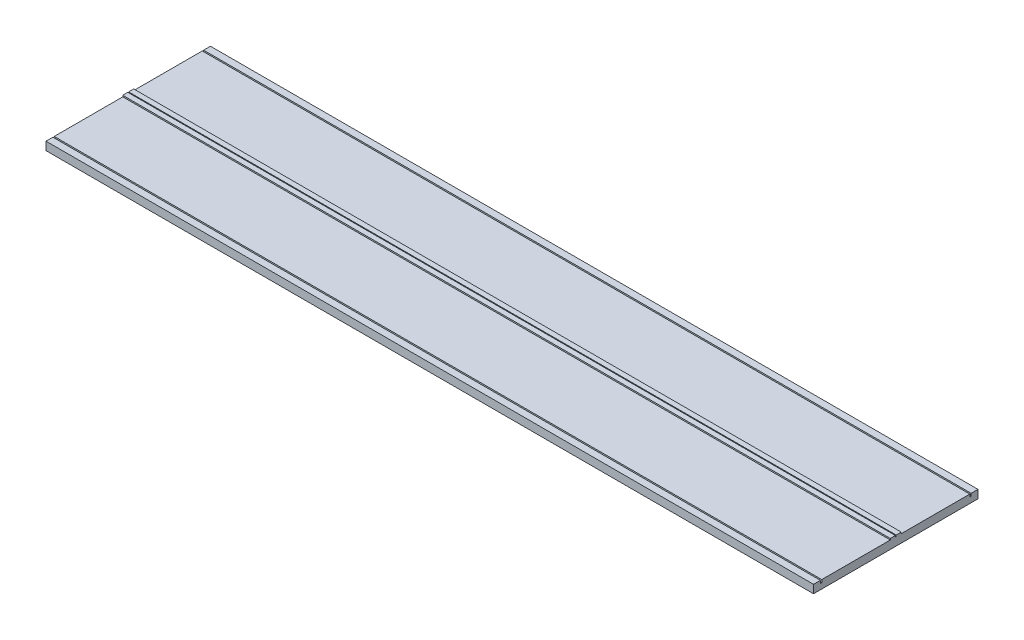
ISO-10303-21;
HEADER;
FILE_DESCRIPTION(('STEP AP214'),'2;1');
FILE_NAME('part.step','',(''),(''),'','','');
FILE_SCHEMA(('AUTOMOTIVE_DESIGN { 1 0 10303 214 1 1 1 1 }'));
ENDSEC;
DATA;
#1=APPLICATION_CONTEXT('core data for automotive mechanical design processes');
#2=APPLICATION_PROTOCOL_DEFINITION('international standard','automotive_design',2000,#1);
#3=PRODUCT_CONTEXT('',#1,'mechanical');
#4=PRODUCT('Part','Part','',(#3));
#5=PRODUCT_RELATED_PRODUCT_CATEGORY('part','',(#4));
#6=PRODUCT_DEFINITION_FORMATION('','',#4);
#7=PRODUCT_DEFINITION_CONTEXT('part definition',#1,'design');
#8=PRODUCT_DEFINITION('design','',#6,#7);
#9=PRODUCT_DEFINITION_SHAPE('','',#8);
#10=(LENGTH_UNIT() NAMED_UNIT(*) SI_UNIT(.MILLI.,.METRE.));
#11=(NAMED_UNIT(*) PLANE_ANGLE_UNIT() SI_UNIT($,.RADIAN.));
#12=(NAMED_UNIT(*) SI_UNIT($,.STERADIAN.) SOLID_ANGLE_UNIT());
#13=UNCERTAINTY_MEASURE_WITH_UNIT(LENGTH_MEASURE(1.E-05),#10,'distance_accuracy_value','');
#14=(GEOMETRIC_REPRESENTATION_CONTEXT(3) GLOBAL_UNCERTAINTY_ASSIGNED_CONTEXT((#13)) GLOBAL_UNIT_ASSIGNED_CONTEXT((#10,
#11,#12)) REPRESENTATION_CONTEXT('',''));
#15=CARTESIAN_POINT('',(0.,0.,0.));
#16=DIRECTION('',(0.,0.,1.));
#17=DIRECTION('',(1.,0.,0.));
#18=AXIS2_PLACEMENT_3D('',#15,#16,#17);
#19=CARTESIAN_POINT('',(-140.,-3.,30.));
#20=DIRECTION('',(1.,0.,0.));
#21=DIRECTION('',(0.,0.,-1.));
#22=AXIS2_PLACEMENT_3D('',#19,#20,#21);
#23=PLANE('',#22);
#24=DIRECTION('',(0.,-1.,0.));
#25=VECTOR('',#24,1.);
#26=CARTESIAN_POINT('',(-140.,0.,-0.15));
#27=LINE('',#26,#25);
#28=CARTESIAN_POINT('',(-140.,0.5,-0.15));
#29=VERTEX_POINT('',#28);
#30=CARTESIAN_POINT('',(-140.,0.,-0.15));
#31=VERTEX_POINT('',#30);
#32=EDGE_CURVE('E183',#29,#31,#27,.T.);
#33=ORIENTED_EDGE('',*,*,#32,.F.);
#34=DIRECTION('',(0.,0.,-1.));
#35=VECTOR('',#34,1.);
#36=CARTESIAN_POINT('',(-140.,0.5,0.));
#37=LINE('',#36,#35);
#38=CARTESIAN_POINT('',(-140.,0.5,-1.99999999999999));
#39=VERTEX_POINT('',#38);
#40=EDGE_CURVE('E211',#29,#39,#37,.T.);
#41=ORIENTED_EDGE('',*,*,#40,.T.);
#42=DIRECTION('',(0.,-1.,0.));
#43=VECTOR('',#42,1.);
#44=CARTESIAN_POINT('',(-140.,0.5,-1.99999999999999));
#45=LINE('',#44,#43);
#46=CARTESIAN_POINT('',(-140.,0.,-2.));
#47=VERTEX_POINT('',#46);
#48=EDGE_CURVE('E210',#39,#47,#45,.T.);
#49=ORIENTED_EDGE('',*,*,#48,.T.);
#50=DIRECTION('',(0.,0.,-1.));
#51=VECTOR('',#50,1.);
#52=CARTESIAN_POINT('',(-140.,0.,30.));
#53=LINE('',#52,#51);
#54=CARTESIAN_POINT('',(-140.,0.,-27.));
#55=VERTEX_POINT('',#54);
#56=EDGE_CURVE('E315',#47,#55,#53,.T.);
#57=ORIENTED_EDGE('',*,*,#56,.T.);
#58=DIRECTION('',(0.,1.,0.));
#59=VECTOR('',#58,1.);
#60=CARTESIAN_POINT('',(-140.,-1.,-27.));
#61=LINE('',#60,#59);
#62=CARTESIAN_POINT('',(-140.,-1.,-27.));
#63=VERTEX_POINT('',#62);
#64=EDGE_CURVE('E275',#63,#55,#61,.T.);
#65=ORIENTED_EDGE('',*,*,#64,.F.);
#66=DIRECTION('',(0.,0.,1.));
#67=VECTOR('',#66,1.);
#68=CARTESIAN_POINT('',(-140.,-1.,-27.5));
#69=LINE('',#68,#67);
#70=CARTESIAN_POINT('',(-140.,-1.,-27.5));
#71=VERTEX_POINT('',#70);
#72=EDGE_CURVE('E263',#71,#63,#69,.T.);
#73=ORIENTED_EDGE('',*,*,#72,.F.);
#74=DIRECTION('',(0.,1.,0.));
#75=VECTOR('',#74,1.);
#76=CARTESIAN_POINT('',(-140.,-1.,-27.5));
#77=LINE('',#76,#75);
#78=CARTESIAN_POINT('',(-140.,0.,-27.5));
#79=VERTEX_POINT('',#78);
#80=EDGE_CURVE('E280',#71,#79,#77,.T.);
#81=ORIENTED_EDGE('',*,*,#80,.T.);
#82=CARTESIAN_POINT('',(-140.,0.,-30.));
#83=VERTEX_POINT('',#82);
#84=EDGE_CURVE('E312',#79,#83,#53,.T.);
#85=ORIENTED_EDGE('',*,*,#84,.T.);
#86=DIRECTION('',(0.,1.,0.));
#87=VECTOR('',#86,1.);
#88=CARTESIAN_POINT('',(-140.,-3.,-30.));
#89=LINE('',#88,#87);
#90=CARTESIAN_POINT('',(-140.,-3.,-30.));
#91=VERTEX_POINT('',#90);
#92=EDGE_CURVE('E44',#91,#83,#89,.T.);
#93=ORIENTED_EDGE('',*,*,#92,.F.);
#94=DIRECTION('',(0.,0.,-1.));
#95=VECTOR('',#94,1.);
#96=CARTESIAN_POINT('',(-140.,-3.,30.));
#97=LINE('',#96,#95);
#98=CARTESIAN_POINT('',(-140.,-3.,30.));
#99=VERTEX_POINT('',#98);
#100=EDGE_CURVE('E300',#99,#91,#97,.T.);
#101=ORIENTED_EDGE('',*,*,#100,.F.);
#102=DIRECTION('',(0.,1.,0.));
#103=VECTOR('',#102,1.);
#104=CARTESIAN_POINT('',(-140.,-3.,30.));
#105=LINE('',#104,#103);
#106=CARTESIAN_POINT('',(-140.,0.,30.));
#107=VERTEX_POINT('',#106);
#108=EDGE_CURVE('E11',#99,#107,#105,.T.);
#109=ORIENTED_EDGE('',*,*,#108,.T.);
#110=CARTESIAN_POINT('',(-140.,0.,27.5));
#111=VERTEX_POINT('',#110);
#112=EDGE_CURVE('E295',#107,#111,#53,.T.);
#113=ORIENTED_EDGE('',*,*,#112,.T.);
#114=DIRECTION('',(0.,1.,0.));
#115=VECTOR('',#114,1.);
#116=CARTESIAN_POINT('',(-140.,-1.,27.5));
#117=LINE('',#116,#115);
#118=CARTESIAN_POINT('',(-140.,-1.,27.5));
#119=VERTEX_POINT('',#118);
#120=EDGE_CURVE('E250',#119,#111,#117,.T.);
#121=ORIENTED_EDGE('',*,*,#120,.F.);
#122=DIRECTION('',(0.,0.,-1.));
#123=VECTOR('',#122,1.);
#124=CARTESIAN_POINT('',(-140.,-1.,27.5));
#125=LINE('',#124,#123);
#126=CARTESIAN_POINT('',(-140.,-1.,27.));
#127=VERTEX_POINT('',#126);
#128=EDGE_CURVE('E238',#119,#127,#125,.T.);
#129=ORIENTED_EDGE('',*,*,#128,.T.);
#130=DIRECTION('',(0.,1.,0.));
#131=VECTOR('',#130,1.);
#132=CARTESIAN_POINT('',(-140.,-1.,27.));
#133=LINE('',#132,#131);
#134=CARTESIAN_POINT('',(-140.,0.,27.));
#135=VERTEX_POINT('',#134);
#136=EDGE_CURVE('E253',#127,#135,#133,.T.);
#137=ORIENTED_EDGE('',*,*,#136,.T.);
#138=CARTESIAN_POINT('',(-140.,0.,2.00000000000003));
#139=VERTEX_POINT('',#138);
#140=EDGE_CURVE('E314',#135,#139,#53,.T.);
#141=ORIENTED_EDGE('',*,*,#140,.T.);
#142=DIRECTION('',(0.,-1.,0.));
#143=VECTOR('',#142,1.);
#144=CARTESIAN_POINT('',(-140.,0.5,2.00000000000003));
#145=LINE('',#144,#143);
#146=CARTESIAN_POINT('',(-140.,0.5,2.00000000000003));
#147=VERTEX_POINT('',#146);
#148=EDGE_CURVE('E214',#147,#139,#145,.T.);
#149=ORIENTED_EDGE('',*,*,#148,.F.);
#150=CARTESIAN_POINT('',(-140.,0.5,0.150000000000042));
#151=VERTEX_POINT('',#150);
#152=EDGE_CURVE('E193',#147,#151,#37,.T.);
#153=ORIENTED_EDGE('',*,*,#152,.T.);
#154=DIRECTION('',(0.,-1.,0.));
#155=VECTOR('',#154,1.);
#156=CARTESIAN_POINT('',(-140.,0.,0.15));
#157=LINE('',#156,#155);
#158=CARTESIAN_POINT('',(-140.,0.,0.15));
#159=VERTEX_POINT('',#158);
#160=EDGE_CURVE('E52',#151,#159,#157,.T.);
#161=ORIENTED_EDGE('',*,*,#160,.T.);
#162=DIRECTION('',(0.,0.,1.));
#163=VECTOR('',#162,1.);
#164=CARTESIAN_POINT('',(-140.,0.,0.));
#165=LINE('',#164,#163);
#166=EDGE_CURVE('E175',#31,#159,#165,.T.);
#167=ORIENTED_EDGE('',*,*,#166,.F.);
#168=EDGE_LOOP('',(#33,#41,#49,#57,#65,#73,#81,#85,#93,#101,#109,#113,#121,#129,#137,#141,#149,
#153,#161,#167));
#169=FACE_BOUND('',#168,.T.);
#170=ADVANCED_FACE('F35',(#169),#23,.F.);
#171=CARTESIAN_POINT('',(140.,-3.,30.));
#172=DIRECTION('',(1.,0.,0.));
#173=DIRECTION('',(0.,0.,-1.));
#174=AXIS2_PLACEMENT_3D('',#171,#172,#173);
#175=PLANE('',#174);
#176=DIRECTION('',(0.,0.,1.));
#177=VECTOR('',#176,1.);
#178=CARTESIAN_POINT('',(140.,0.5,0.));
#179=LINE('',#178,#177);
#180=CARTESIAN_POINT('',(140.,0.5,-1.99999999999999));
#181=VERTEX_POINT('',#180);
#182=CARTESIAN_POINT('',(140.,0.5,-0.15));
#183=VERTEX_POINT('',#182);
#184=EDGE_CURVE('E224',#181,#183,#179,.T.);
#185=ORIENTED_EDGE('',*,*,#184,.T.);
#186=DIRECTION('',(0.,-1.,0.));
#187=VECTOR('',#186,1.);
#188=CARTESIAN_POINT('',(140.,0.,-0.15));
#189=LINE('',#188,#187);
#190=CARTESIAN_POINT('',(140.,0.,-0.15));
#191=VERTEX_POINT('',#190);
#192=EDGE_CURVE('E194',#183,#191,#189,.T.);
#193=ORIENTED_EDGE('',*,*,#192,.T.);
#194=DIRECTION('',(0.,0.,1.));
#195=VECTOR('',#194,1.);
#196=CARTESIAN_POINT('',(140.,0.,0.));
#197=LINE('',#196,#195);
#198=CARTESIAN_POINT('',(140.,0.,0.15));
#199=VERTEX_POINT('',#198);
#200=EDGE_CURVE('E197',#191,#199,#197,.T.);
#201=ORIENTED_EDGE('',*,*,#200,.T.);
#202=DIRECTION('',(0.,-1.,0.));
#203=VECTOR('',#202,1.);
#204=CARTESIAN_POINT('',(140.,0.,0.15));
#205=LINE('',#204,#203);
#206=CARTESIAN_POINT('',(140.,0.499999999999988,0.150000000000042));
#207=VERTEX_POINT('',#206);
#208=EDGE_CURVE('E187',#207,#199,#205,.T.);
#209=ORIENTED_EDGE('',*,*,#208,.F.);
#210=CARTESIAN_POINT('',(140.,0.5,2.00000000000003));
#211=VERTEX_POINT('',#210);
#212=EDGE_CURVE('E223',#207,#211,#179,.T.);
#213=ORIENTED_EDGE('',*,*,#212,.T.);
#214=DIRECTION('',(0.,-1.,0.));
#215=VECTOR('',#214,1.);
#216=CARTESIAN_POINT('',(140.,0.5,2.00000000000003));
#217=LINE('',#216,#215);
#218=CARTESIAN_POINT('',(140.,0.,2.00000000000003));
#219=VERTEX_POINT('',#218);
#220=EDGE_CURVE('E220',#211,#219,#217,.T.);
#221=ORIENTED_EDGE('',*,*,#220,.T.);
#222=DIRECTION('',(0.,0.,-1.));
#223=VECTOR('',#222,1.);
#224=CARTESIAN_POINT('',(140.,0.,30.));
#225=LINE('',#224,#223);
#226=CARTESIAN_POINT('',(140.,0.,27.));
#227=VERTEX_POINT('',#226);
#228=EDGE_CURVE('E60',#227,#219,#225,.T.);
#229=ORIENTED_EDGE('',*,*,#228,.F.);
#230=DIRECTION('',(0.,1.,0.));
#231=VECTOR('',#230,1.);
#232=CARTESIAN_POINT('',(140.,-1.,27.));
#233=LINE('',#232,#231);
#234=CARTESIAN_POINT('',(140.,-1.,27.));
#235=VERTEX_POINT('',#234);
#236=EDGE_CURVE('E257',#235,#227,#233,.T.);
#237=ORIENTED_EDGE('',*,*,#236,.F.);
#238=DIRECTION('',(0.,0.,-1.));
#239=VECTOR('',#238,1.);
#240=CARTESIAN_POINT('',(140.,-1.,27.5));
#241=LINE('',#240,#239);
#242=CARTESIAN_POINT('',(140.,-1.,27.5));
#243=VERTEX_POINT('',#242);
#244=EDGE_CURVE('E245',#243,#235,#241,.T.);
#245=ORIENTED_EDGE('',*,*,#244,.F.);
#246=DIRECTION('',(0.,1.,0.));
#247=VECTOR('',#246,1.);
#248=CARTESIAN_POINT('',(140.,-1.,27.5));
#249=LINE('',#248,#247);
#250=CARTESIAN_POINT('',(140.,0.,27.5));
#251=VERTEX_POINT('',#250);
#252=EDGE_CURVE('E259',#243,#251,#249,.T.);
#253=ORIENTED_EDGE('',*,*,#252,.T.);
#254=CARTESIAN_POINT('',(140.,0.,30.));
#255=VERTEX_POINT('',#254);
#256=EDGE_CURVE('E305',#255,#251,#225,.T.);
#257=ORIENTED_EDGE('',*,*,#256,.F.);
#258=DIRECTION('',(0.,1.,0.));
#259=VECTOR('',#258,1.);
#260=CARTESIAN_POINT('',(140.,-3.,30.));
#261=LINE('',#260,#259);
#262=CARTESIAN_POINT('',(140.,-3.,30.));
#263=VERTEX_POINT('',#262);
#264=EDGE_CURVE('E39',#263,#255,#261,.T.);
#265=ORIENTED_EDGE('',*,*,#264,.F.);
#266=DIRECTION('',(0.,0.,-1.));
#267=VECTOR('',#266,1.);
#268=CARTESIAN_POINT('',(140.,-3.,30.));
#269=LINE('',#268,#267);
#270=CARTESIAN_POINT('',(140.,-3.,-30.));
#271=VERTEX_POINT('',#270);
#272=EDGE_CURVE('E294',#263,#271,#269,.T.);
#273=ORIENTED_EDGE('',*,*,#272,.T.);
#274=DIRECTION('',(0.,1.,0.));
#275=VECTOR('',#274,1.);
#276=CARTESIAN_POINT('',(140.,-3.,-30.));
#277=LINE('',#276,#275);
#278=CARTESIAN_POINT('',(140.,0.,-30.));
#279=VERTEX_POINT('',#278);
#280=EDGE_CURVE('E318',#271,#279,#277,.T.);
#281=ORIENTED_EDGE('',*,*,#280,.T.);
#282=CARTESIAN_POINT('',(140.,0.,-27.5));
#283=VERTEX_POINT('',#282);
#284=EDGE_CURVE('E304',#283,#279,#225,.T.);
#285=ORIENTED_EDGE('',*,*,#284,.F.);
#286=DIRECTION('',(0.,1.,0.));
#287=VECTOR('',#286,1.);
#288=CARTESIAN_POINT('',(140.,-1.,-27.5));
#289=LINE('',#288,#287);
#290=CARTESIAN_POINT('',(140.,-1.,-27.5));
#291=VERTEX_POINT('',#290);
#292=EDGE_CURVE('E284',#291,#283,#289,.T.);
#293=ORIENTED_EDGE('',*,*,#292,.F.);
#294=DIRECTION('',(0.,0.,1.));
#295=VECTOR('',#294,1.);
#296=CARTESIAN_POINT('',(140.,-1.,-27.5));
#297=LINE('',#296,#295);
#298=CARTESIAN_POINT('',(140.,-1.,-27.));
#299=VERTEX_POINT('',#298);
#300=EDGE_CURVE('E270',#291,#299,#297,.T.);
#301=ORIENTED_EDGE('',*,*,#300,.T.);
#302=DIRECTION('',(0.,1.,0.));
#303=VECTOR('',#302,1.);
#304=CARTESIAN_POINT('',(140.,-1.,-27.));
#305=LINE('',#304,#303);
#306=CARTESIAN_POINT('',(140.,0.,-27.));
#307=VERTEX_POINT('',#306);
#308=EDGE_CURVE('E286',#299,#307,#305,.T.);
#309=ORIENTED_EDGE('',*,*,#308,.T.);
#310=CARTESIAN_POINT('',(140.,0.,-2.));
#311=VERTEX_POINT('',#310);
#312=EDGE_CURVE('E309',#311,#307,#225,.T.);
#313=ORIENTED_EDGE('',*,*,#312,.F.);
#314=DIRECTION('',(0.,-1.,0.));
#315=VECTOR('',#314,1.);
#316=CARTESIAN_POINT('',(140.,0.5,-1.99999999999999));
#317=LINE('',#316,#315);
#318=EDGE_CURVE('E206',#181,#311,#317,.T.);
#319=ORIENTED_EDGE('',*,*,#318,.F.);
#320=EDGE_LOOP('',(#185,#193,#201,#209,#213,#221,#229,#237,#245,#253,#257,#265,#273,#281,#285,
#293,#301,#309,#313,#319));
#321=FACE_BOUND('',#320,.T.);
#322=ADVANCED_FACE('F328',(#321),#175,.T.);
#323=CARTESIAN_POINT('',(-140.,0.5,0.));
#324=DIRECTION('',(0.,1.,0.));
#325=DIRECTION('',(0.,0.,1.));
#326=AXIS2_PLACEMENT_3D('',#323,#324,#325);
#327=PLANE('',#326);
#328=ORIENTED_EDGE('',*,*,#40,.F.);
#329=DIRECTION('',(1.,0.,0.));
#330=VECTOR('',#329,1.);
#331=CARTESIAN_POINT('',(-140.,0.5,-0.15));
#332=LINE('',#331,#330);
#333=EDGE_CURVE('E203',#29,#183,#332,.T.);
#334=ORIENTED_EDGE('',*,*,#333,.T.);
#335=ORIENTED_EDGE('',*,*,#184,.F.);
#336=DIRECTION('',(1.,0.,0.));
#337=VECTOR('',#336,1.);
#338=CARTESIAN_POINT('',(-140.,0.5,-1.99999999999999));
#339=LINE('',#338,#337);
#340=EDGE_CURVE('E234',#39,#181,#339,.T.);
#341=ORIENTED_EDGE('',*,*,#340,.F.);
#342=EDGE_LOOP('',(#328,#334,#335,#341));
#343=FACE_BOUND('',#342,.T.);
#344=ADVANCED_FACE('F378',(#343),#327,.T.);
#345=CARTESIAN_POINT('',(0.,0.,0.));
#346=DIRECTION('',(0.,1.,0.));
#347=DIRECTION('',(0.,0.,1.));
#348=AXIS2_PLACEMENT_3D('',#345,#346,#347);
#349=PLANE('',#348);
#350=ORIENTED_EDGE('',*,*,#56,.F.);
#351=DIRECTION('',(1.,0.,0.));
#352=VECTOR('',#351,1.);
#353=CARTESIAN_POINT('',(-140.,0.,-2.));
#354=LINE('',#353,#352);
#355=EDGE_CURVE('E231',#47,#311,#354,.T.);
#356=ORIENTED_EDGE('',*,*,#355,.T.);
#357=ORIENTED_EDGE('',*,*,#312,.T.);
#358=DIRECTION('',(1.,0.,0.));
#359=VECTOR('',#358,1.);
#360=CARTESIAN_POINT('',(-140.,0.,-27.));
#361=LINE('',#360,#359);
#362=EDGE_CURVE('E256',#55,#307,#361,.T.);
#363=ORIENTED_EDGE('',*,*,#362,.F.);
#364=EDGE_LOOP('',(#350,#356,#357,#363));
#365=FACE_BOUND('',#364,.T.);
#366=ADVANCED_FACE('F349',(#365),#349,.T.);
#367=DIRECTION('',(1.,0.,0.));
#368=VECTOR('',#367,1.);
#369=CARTESIAN_POINT('',(-140.,0.,2.00000000000003));
#370=LINE('',#369,#368);
#371=EDGE_CURVE('E229',#139,#219,#370,.T.);
#372=ORIENTED_EDGE('',*,*,#371,.F.);
#373=ORIENTED_EDGE('',*,*,#140,.F.);
#374=DIRECTION('',(1.,0.,0.));
#375=VECTOR('',#374,1.);
#376=CARTESIAN_POINT('',(-140.,0.,27.));
#377=LINE('',#376,#375);
#378=EDGE_CURVE('E242',#135,#227,#377,.T.);
#379=ORIENTED_EDGE('',*,*,#378,.T.);
#380=ORIENTED_EDGE('',*,*,#228,.T.);
#381=EDGE_LOOP('',(#372,#373,#379,#380));
#382=FACE_BOUND('',#381,.T.);
#383=ADVANCED_FACE('F389',(#382),#349,.T.);
#384=ORIENTED_EDGE('',*,*,#84,.F.);
#385=DIRECTION('',(1.,0.,0.));
#386=VECTOR('',#385,1.);
#387=CARTESIAN_POINT('',(-140.,0.,-27.5));
#388=LINE('',#387,#386);
#389=EDGE_CURVE('E267',#79,#283,#388,.T.);
#390=ORIENTED_EDGE('',*,*,#389,.T.);
#391=ORIENTED_EDGE('',*,*,#284,.T.);
#392=DIRECTION('',(1.,0.,0.));
#393=VECTOR('',#392,1.);
#394=CARTESIAN_POINT('',(-140.,0.,-30.));
#395=LINE('',#394,#393);
#396=EDGE_CURVE('E308',#83,#279,#395,.T.);
#397=ORIENTED_EDGE('',*,*,#396,.F.);
#398=EDGE_LOOP('',(#384,#390,#391,#397));
#399=FACE_BOUND('',#398,.T.);
#400=ADVANCED_FACE('F345',(#399),#349,.T.);
#401=CARTESIAN_POINT('',(-140.,-3.,30.));
#402=DIRECTION('',(0.,0.,1.));
#403=DIRECTION('',(1.,0.,0.));
#404=AXIS2_PLACEMENT_3D('',#401,#402,#403);
#405=PLANE('',#404);
#406=DIRECTION('',(1.,0.,0.));
#407=VECTOR('',#406,1.);
#408=CARTESIAN_POINT('',(-140.,0.,30.));
#409=LINE('',#408,#407);
#410=EDGE_CURVE('E283',#107,#255,#409,.T.);
#411=ORIENTED_EDGE('',*,*,#410,.F.);
#412=ORIENTED_EDGE('',*,*,#108,.F.);
#413=DIRECTION('',(1.,0.,0.));
#414=VECTOR('',#413,1.);
#415=CARTESIAN_POINT('',(-140.,-3.,30.));
#416=LINE('',#415,#414);
#417=EDGE_CURVE('E291',#99,#263,#416,.T.);
#418=ORIENTED_EDGE('',*,*,#417,.T.);
#419=ORIENTED_EDGE('',*,*,#264,.T.);
#420=EDGE_LOOP('',(#411,#412,#418,#419));
#421=FACE_BOUND('',#420,.T.);
#422=ADVANCED_FACE('F37',(#421),#405,.T.);
#423=CARTESIAN_POINT('',(-140.,-3.,-30.));
#424=DIRECTION('',(0.,0.,1.));
#425=DIRECTION('',(1.,0.,0.));
#426=AXIS2_PLACEMENT_3D('',#423,#424,#425);
#427=PLANE('',#426);
#428=ORIENTED_EDGE('',*,*,#396,.T.);
#429=ORIENTED_EDGE('',*,*,#280,.F.);
#430=DIRECTION('',(1.,0.,0.));
#431=VECTOR('',#430,1.);
#432=CARTESIAN_POINT('',(-140.,-3.,-30.));
#433=LINE('',#432,#431);
#434=EDGE_CURVE('E298',#91,#271,#433,.T.);
#435=ORIENTED_EDGE('',*,*,#434,.F.);
#436=ORIENTED_EDGE('',*,*,#92,.T.);
#437=EDGE_LOOP('',(#428,#429,#435,#436));
#438=FACE_BOUND('',#437,.T.);
#439=ADVANCED_FACE('F341',(#438),#427,.F.);
#440=CARTESIAN_POINT('',(0.,-3.,0.));
#441=DIRECTION('',(0.,1.,0.));
#442=DIRECTION('',(0.,0.,1.));
#443=AXIS2_PLACEMENT_3D('',#440,#441,#442);
#444=PLANE('',#443);
#445=ORIENTED_EDGE('',*,*,#417,.F.);
#446=ORIENTED_EDGE('',*,*,#100,.T.);
#447=ORIENTED_EDGE('',*,*,#434,.T.);
#448=ORIENTED_EDGE('',*,*,#272,.F.);
#449=EDGE_LOOP('',(#445,#446,#447,#448));
#450=FACE_BOUND('',#449,.T.);
#451=ADVANCED_FACE('F339',(#450),#444,.F.);
#452=DIRECTION('',(1.,0.,0.));
#453=VECTOR('',#452,1.);
#454=CARTESIAN_POINT('',(-140.,0.,27.5));
#455=LINE('',#454,#453);
#456=EDGE_CURVE('E237',#111,#251,#455,.T.);
#457=ORIENTED_EDGE('',*,*,#456,.F.);
#458=ORIENTED_EDGE('',*,*,#112,.F.);
#459=ORIENTED_EDGE('',*,*,#410,.T.);
#460=ORIENTED_EDGE('',*,*,#256,.T.);
#461=EDGE_LOOP('',(#457,#458,#459,#460));
#462=FACE_BOUND('',#461,.T.);
#463=ADVANCED_FACE('F333',(#462),#349,.T.);
#464=CARTESIAN_POINT('',(-140.,-1.,-27.5));
#465=DIRECTION('',(0.,0.,1.));
#466=DIRECTION('',(1.,0.,0.));
#467=AXIS2_PLACEMENT_3D('',#464,#465,#466);
#468=PLANE('',#467);
#469=ORIENTED_EDGE('',*,*,#389,.F.);
#470=ORIENTED_EDGE('',*,*,#80,.F.);
#471=DIRECTION('',(1.,0.,0.));
#472=VECTOR('',#471,1.);
#473=CARTESIAN_POINT('',(-140.,-1.,-27.5));
#474=LINE('',#473,#472);
#475=EDGE_CURVE('E273',#71,#291,#474,.T.);
#476=ORIENTED_EDGE('',*,*,#475,.T.);
#477=ORIENTED_EDGE('',*,*,#292,.T.);
#478=EDGE_LOOP('',(#469,#470,#476,#477));
#479=FACE_BOUND('',#478,.T.);
#480=ADVANCED_FACE('F363',(#479),#468,.T.);
#481=CARTESIAN_POINT('',(-140.,-1.,-27.));
#482=DIRECTION('',(0.,0.,1.));
#483=DIRECTION('',(1.,0.,0.));
#484=AXIS2_PLACEMENT_3D('',#481,#482,#483);
#485=PLANE('',#484);
#486=ORIENTED_EDGE('',*,*,#362,.T.);
#487=ORIENTED_EDGE('',*,*,#308,.F.);
#488=DIRECTION('',(1.,0.,0.));
#489=VECTOR('',#488,1.);
#490=CARTESIAN_POINT('',(-140.,-1.,-27.));
#491=LINE('',#490,#489);
#492=EDGE_CURVE('E266',#63,#299,#491,.T.);
#493=ORIENTED_EDGE('',*,*,#492,.F.);
#494=ORIENTED_EDGE('',*,*,#64,.T.);
#495=EDGE_LOOP('',(#486,#487,#493,#494));
#496=FACE_BOUND('',#495,.T.);
#497=ADVANCED_FACE('F353',(#496),#485,.F.);
#498=CARTESIAN_POINT('',(0.,-1.,0.));
#499=DIRECTION('',(0.,1.,0.));
#500=DIRECTION('',(0.,0.,1.));
#501=AXIS2_PLACEMENT_3D('',#498,#499,#500);
#502=PLANE('',#501);
#503=ORIENTED_EDGE('',*,*,#72,.T.);
#504=ORIENTED_EDGE('',*,*,#492,.T.);
#505=ORIENTED_EDGE('',*,*,#300,.F.);
#506=ORIENTED_EDGE('',*,*,#475,.F.);
#507=EDGE_LOOP('',(#503,#504,#505,#506));
#508=FACE_BOUND('',#507,.T.);
#509=ADVANCED_FACE('F358',(#508),#502,.T.);
#510=CARTESIAN_POINT('',(-140.,-1.,27.));
#511=DIRECTION('',(0.,0.,1.));
#512=DIRECTION('',(1.,0.,0.));
#513=AXIS2_PLACEMENT_3D('',#510,#511,#512);
#514=PLANE('',#513);
#515=ORIENTED_EDGE('',*,*,#378,.F.);
#516=ORIENTED_EDGE('',*,*,#136,.F.);
#517=DIRECTION('',(1.,0.,0.));
#518=VECTOR('',#517,1.);
#519=CARTESIAN_POINT('',(-140.,-1.,27.));
#520=LINE('',#519,#518);
#521=EDGE_CURVE('E248',#127,#235,#520,.T.);
#522=ORIENTED_EDGE('',*,*,#521,.T.);
#523=ORIENTED_EDGE('',*,*,#236,.T.);
#524=EDGE_LOOP('',(#515,#516,#522,#523));
#525=FACE_BOUND('',#524,.T.);
#526=ADVANCED_FACE('F425',(#525),#514,.T.);
#527=CARTESIAN_POINT('',(-140.,-1.,27.5));
#528=DIRECTION('',(0.,0.,1.));
#529=DIRECTION('',(1.,0.,0.));
#530=AXIS2_PLACEMENT_3D('',#527,#528,#529);
#531=PLANE('',#530);
#532=ORIENTED_EDGE('',*,*,#456,.T.);
#533=ORIENTED_EDGE('',*,*,#252,.F.);
#534=DIRECTION('',(1.,0.,0.));
#535=VECTOR('',#534,1.);
#536=CARTESIAN_POINT('',(-140.,-1.,27.5));
#537=LINE('',#536,#535);
#538=EDGE_CURVE('E241',#119,#243,#537,.T.);
#539=ORIENTED_EDGE('',*,*,#538,.F.);
#540=ORIENTED_EDGE('',*,*,#120,.T.);
#541=EDGE_LOOP('',(#532,#533,#539,#540));
#542=FACE_BOUND('',#541,.T.);
#543=ADVANCED_FACE('F420',(#542),#531,.F.);
#544=CARTESIAN_POINT('',(0.,-1.,0.));
#545=DIRECTION('',(0.,1.,0.));
#546=DIRECTION('',(0.,0.,-1.));
#547=AXIS2_PLACEMENT_3D('',#544,#545,#546);
#548=PLANE('',#547);
#549=ORIENTED_EDGE('',*,*,#128,.F.);
#550=ORIENTED_EDGE('',*,*,#538,.T.);
#551=ORIENTED_EDGE('',*,*,#244,.T.);
#552=ORIENTED_EDGE('',*,*,#521,.F.);
#553=EDGE_LOOP('',(#549,#550,#551,#552));
#554=FACE_BOUND('',#553,.T.);
#555=ADVANCED_FACE('F413',(#554),#548,.T.);
#556=CARTESIAN_POINT('',(-140.,0.5,-1.99999999999999));
#557=DIRECTION('',(0.,0.,1.));
#558=DIRECTION('',(0.,-1.,0.));
#559=AXIS2_PLACEMENT_3D('',#556,#557,#558);
#560=PLANE('',#559);
#561=ORIENTED_EDGE('',*,*,#318,.T.);
#562=ORIENTED_EDGE('',*,*,#355,.F.);
#563=ORIENTED_EDGE('',*,*,#48,.F.);
#564=ORIENTED_EDGE('',*,*,#340,.T.);
#565=EDGE_LOOP('',(#561,#562,#563,#564));
#566=FACE_BOUND('',#565,.T.);
#567=ADVANCED_FACE('F411',(#566),#560,.F.);
#568=CARTESIAN_POINT('',(-140.,0.5,2.00000000000003));
#569=DIRECTION('',(0.,0.,1.));
#570=DIRECTION('',(1.,0.,0.));
#571=AXIS2_PLACEMENT_3D('',#568,#569,#570);
#572=PLANE('',#571);
#573=ORIENTED_EDGE('',*,*,#220,.F.);
#574=DIRECTION('',(1.,0.,0.));
#575=VECTOR('',#574,1.);
#576=CARTESIAN_POINT('',(-140.,0.5,2.00000000000003));
#577=LINE('',#576,#575);
#578=EDGE_CURVE('E217',#147,#211,#577,.T.);
#579=ORIENTED_EDGE('',*,*,#578,.F.);
#580=ORIENTED_EDGE('',*,*,#148,.T.);
#581=ORIENTED_EDGE('',*,*,#371,.T.);
#582=EDGE_LOOP('',(#573,#579,#580,#581));
#583=FACE_BOUND('',#582,.T.);
#584=ADVANCED_FACE('F401',(#583),#572,.T.);
#585=DIRECTION('',(1.,0.,0.));
#586=VECTOR('',#585,1.);
#587=CARTESIAN_POINT('',(-140.,0.499999999999988,0.150000000000042));
#588=LINE('',#587,#586);
#589=EDGE_CURVE('E189',#151,#207,#588,.T.);
#590=ORIENTED_EDGE('',*,*,#589,.F.);
#591=ORIENTED_EDGE('',*,*,#152,.F.);
#592=ORIENTED_EDGE('',*,*,#578,.T.);
#593=ORIENTED_EDGE('',*,*,#212,.F.);
#594=EDGE_LOOP('',(#590,#591,#592,#593));
#595=FACE_BOUND('',#594,.T.);
#596=ADVANCED_FACE('F404',(#595),#327,.T.);
#597=CARTESIAN_POINT('',(-140.,0.,-0.15));
#598=DIRECTION('',(0.,0.,1.));
#599=DIRECTION('',(0.,-1.,0.));
#600=AXIS2_PLACEMENT_3D('',#597,#598,#599);
#601=PLANE('',#600);
#602=ORIENTED_EDGE('',*,*,#192,.F.);
#603=ORIENTED_EDGE('',*,*,#333,.F.);
#604=ORIENTED_EDGE('',*,*,#32,.T.);
#605=DIRECTION('',(1.,0.,0.));
#606=VECTOR('',#605,1.);
#607=CARTESIAN_POINT('',(-140.,0.,-0.15));
#608=LINE('',#607,#606);
#609=EDGE_CURVE('E180',#31,#191,#608,.T.);
#610=ORIENTED_EDGE('',*,*,#609,.T.);
#611=EDGE_LOOP('',(#602,#603,#604,#610));
#612=FACE_BOUND('',#611,.T.);
#613=ADVANCED_FACE('F406',(#612),#601,.T.);
#614=CARTESIAN_POINT('',(-140.,0.,0.));
#615=DIRECTION('',(0.,1.,0.));
#616=DIRECTION('',(0.,0.,1.));
#617=AXIS2_PLACEMENT_3D('',#614,#615,#616);
#618=PLANE('',#617);
#619=ORIENTED_EDGE('',*,*,#200,.F.);
#620=ORIENTED_EDGE('',*,*,#609,.F.);
#621=ORIENTED_EDGE('',*,*,#166,.T.);
#622=DIRECTION('',(1.,0.,0.));
#623=VECTOR('',#622,1.);
#624=CARTESIAN_POINT('',(-140.,0.,0.15));
#625=LINE('',#624,#623);
#626=EDGE_CURVE('E178',#159,#199,#625,.T.);
#627=ORIENTED_EDGE('',*,*,#626,.T.);
#628=EDGE_LOOP('',(#619,#620,#621,#627));
#629=FACE_BOUND('',#628,.T.);
#630=ADVANCED_FACE('F177',(#629),#618,.T.);
#631=CARTESIAN_POINT('',(-140.,0.,0.15));
#632=DIRECTION('',(0.,0.,1.));
#633=DIRECTION('',(0.,-1.,0.));
#634=AXIS2_PLACEMENT_3D('',#631,#632,#633);
#635=PLANE('',#634);
#636=ORIENTED_EDGE('',*,*,#208,.T.);
#637=ORIENTED_EDGE('',*,*,#626,.F.);
#638=ORIENTED_EDGE('',*,*,#160,.F.);
#639=ORIENTED_EDGE('',*,*,#589,.T.);
#640=EDGE_LOOP('',(#636,#637,#638,#639));
#641=FACE_BOUND('',#640,.T.);
#642=ADVANCED_FACE('F185',(#641),#635,.F.);
#643=CLOSED_SHELL('',(#170,#322,#344,#366,#383,#400,#422,#439,#451,#463,#480,#497,#509,#526,
#543,#555,#567,#584,#596,#613,#630,#642));
#644=MANIFOLD_SOLID_BREP('B2',#643);
#645=ADVANCED_BREP_SHAPE_REPRESENTATION('',(#18,#644),#14);
#646=SHAPE_DEFINITION_REPRESENTATION(#9,#645);
ENDSEC;
END-ISO-10303-21;
